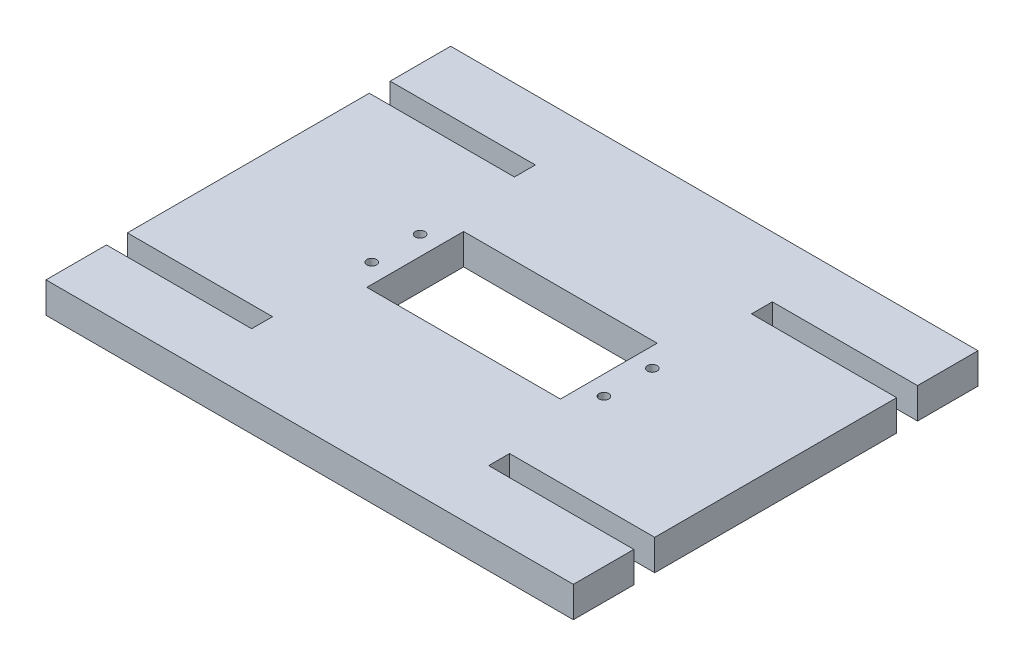
ISO-10303-21;
HEADER;
FILE_DESCRIPTION(('STEP AP214'),'2;1');
FILE_NAME('part.step','',(''),(''),'','','');
FILE_SCHEMA(('AUTOMOTIVE_DESIGN { 1 0 10303 214 1 1 1 1 }'));
ENDSEC;
DATA;
#1=APPLICATION_CONTEXT('core data for automotive mechanical design processes');
#2=APPLICATION_PROTOCOL_DEFINITION('international standard','automotive_design',2000,#1);
#3=PRODUCT_CONTEXT('',#1,'mechanical');
#4=PRODUCT('Part','Part','',(#3));
#5=PRODUCT_RELATED_PRODUCT_CATEGORY('part','',(#4));
#6=PRODUCT_DEFINITION_FORMATION('','',#4);
#7=PRODUCT_DEFINITION_CONTEXT('part definition',#1,'design');
#8=PRODUCT_DEFINITION('design','',#6,#7);
#9=PRODUCT_DEFINITION_SHAPE('','',#8);
#10=(LENGTH_UNIT() NAMED_UNIT(*) SI_UNIT(.MILLI.,.METRE.));
#11=(NAMED_UNIT(*) PLANE_ANGLE_UNIT() SI_UNIT($,.RADIAN.));
#12=(NAMED_UNIT(*) SI_UNIT($,.STERADIAN.) SOLID_ANGLE_UNIT());
#13=UNCERTAINTY_MEASURE_WITH_UNIT(LENGTH_MEASURE(1.E-05),#10,'distance_accuracy_value','');
#14=(GEOMETRIC_REPRESENTATION_CONTEXT(3) GLOBAL_UNCERTAINTY_ASSIGNED_CONTEXT((#13)) GLOBAL_UNIT_ASSIGNED_CONTEXT((#10,
#11,#12)) REPRESENTATION_CONTEXT('',''));
#15=CARTESIAN_POINT('',(0.,0.,0.));
#16=DIRECTION('',(0.,0.,1.));
#17=DIRECTION('',(1.,0.,0.));
#18=AXIS2_PLACEMENT_3D('',#15,#16,#17);
#19=CARTESIAN_POINT('',(0.,6.35,-83.636));
#20=DIRECTION('',(1.,0.,0.));
#21=DIRECTION('',(0.,0.,-1.));
#22=AXIS2_PLACEMENT_3D('',#19,#20,#21);
#23=PLANE('',#22);
#24=DIRECTION('',(0.,0.,1.));
#25=VECTOR('',#24,1.);
#26=CARTESIAN_POINT('',(0.,0.,-83.636));
#27=LINE('',#26,#25);
#28=CARTESIAN_POINT('',(0.,0.,-83.636));
#29=VERTEX_POINT('',#28);
#30=CARTESIAN_POINT('',(0.,0.,-71.136));
#31=VERTEX_POINT('',#30);
#32=EDGE_CURVE('E235',#29,#31,#27,.T.);
#33=ORIENTED_EDGE('',*,*,#32,.T.);
#34=DIRECTION('',(0.,-1.,0.));
#35=VECTOR('',#34,1.);
#36=CARTESIAN_POINT('',(0.,6.35,-71.136));
#37=LINE('',#36,#35);
#38=CARTESIAN_POINT('',(0.,6.35,-71.136));
#39=VERTEX_POINT('',#38);
#40=EDGE_CURVE('E11',#39,#31,#37,.T.);
#41=ORIENTED_EDGE('',*,*,#40,.F.);
#42=DIRECTION('',(0.,0.,1.));
#43=VECTOR('',#42,1.);
#44=CARTESIAN_POINT('',(0.,6.35,-83.636));
#45=LINE('',#44,#43);
#46=CARTESIAN_POINT('',(0.,6.35,-83.636));
#47=VERTEX_POINT('',#46);
#48=EDGE_CURVE('E239',#47,#39,#45,.T.);
#49=ORIENTED_EDGE('',*,*,#48,.F.);
#50=DIRECTION('',(0.,-1.,0.));
#51=VECTOR('',#50,1.);
#52=CARTESIAN_POINT('',(0.,6.35,-83.636));
#53=LINE('',#52,#51);
#54=EDGE_CURVE('E281',#47,#29,#53,.T.);
#55=ORIENTED_EDGE('',*,*,#54,.T.);
#56=EDGE_LOOP('',(#33,#41,#49,#55));
#57=FACE_BOUND('',#56,.T.);
#58=ADVANCED_FACE('F37',(#57),#23,.F.);
#59=CARTESIAN_POINT('',(0.,6.35,-71.136));
#60=DIRECTION('',(0.,0.,-1.));
#61=DIRECTION('',(-1.,0.,0.));
#62=AXIS2_PLACEMENT_3D('',#59,#60,#61);
#63=PLANE('',#62);
#64=DIRECTION('',(1.,0.,0.));
#65=VECTOR('',#64,1.);
#66=CARTESIAN_POINT('',(0.,0.,-71.136));
#67=LINE('',#66,#65);
#68=CARTESIAN_POINT('',(30.,0.,-71.136));
#69=VERTEX_POINT('',#68);
#70=EDGE_CURVE('E284',#31,#69,#67,.T.);
#71=ORIENTED_EDGE('',*,*,#70,.T.);
#72=DIRECTION('',(0.,-1.,0.));
#73=VECTOR('',#72,1.);
#74=CARTESIAN_POINT('',(30.,6.35,-71.136));
#75=LINE('',#74,#73);
#76=CARTESIAN_POINT('',(30.,6.35,-71.136));
#77=VERTEX_POINT('',#76);
#78=EDGE_CURVE('E45',#77,#69,#75,.T.);
#79=ORIENTED_EDGE('',*,*,#78,.F.);
#80=DIRECTION('',(1.,0.,0.));
#81=VECTOR('',#80,1.);
#82=CARTESIAN_POINT('',(0.,6.35,-71.136));
#83=LINE('',#82,#81);
#84=EDGE_CURVE('E242',#39,#77,#83,.T.);
#85=ORIENTED_EDGE('',*,*,#84,.F.);
#86=ORIENTED_EDGE('',*,*,#40,.T.);
#87=EDGE_LOOP('',(#71,#79,#85,#86));
#88=FACE_BOUND('',#87,.T.);
#89=ADVANCED_FACE('F416',(#88),#63,.F.);
#90=CARTESIAN_POINT('',(30.,6.35,-71.136));
#91=DIRECTION('',(1.,0.,0.));
#92=DIRECTION('',(0.,0.,-1.));
#93=AXIS2_PLACEMENT_3D('',#90,#91,#92);
#94=PLANE('',#93);
#95=DIRECTION('',(0.,0.,1.));
#96=VECTOR('',#95,1.);
#97=CARTESIAN_POINT('',(30.,0.,-71.136));
#98=LINE('',#97,#96);
#99=CARTESIAN_POINT('',(30.,0.,-66.818));
#100=VERTEX_POINT('',#99);
#101=EDGE_CURVE('E286',#69,#100,#98,.T.);
#102=ORIENTED_EDGE('',*,*,#101,.T.);
#103=DIRECTION('',(0.,-1.,0.));
#104=VECTOR('',#103,1.);
#105=CARTESIAN_POINT('',(30.,6.35,-66.818));
#106=LINE('',#105,#104);
#107=CARTESIAN_POINT('',(30.,6.35,-66.818));
#108=VERTEX_POINT('',#107);
#109=EDGE_CURVE('E371',#108,#100,#106,.T.);
#110=ORIENTED_EDGE('',*,*,#109,.F.);
#111=DIRECTION('',(0.,0.,1.));
#112=VECTOR('',#111,1.);
#113=CARTESIAN_POINT('',(30.,6.35,-71.136));
#114=LINE('',#113,#112);
#115=EDGE_CURVE('E245',#77,#108,#114,.T.);
#116=ORIENTED_EDGE('',*,*,#115,.F.);
#117=ORIENTED_EDGE('',*,*,#78,.T.);
#118=EDGE_LOOP('',(#102,#110,#116,#117));
#119=FACE_BOUND('',#118,.T.);
#120=ADVANCED_FACE('F421',(#119),#94,.F.);
#121=CARTESIAN_POINT('',(0.,6.35,-66.818));
#122=DIRECTION('',(0.,0.,1.));
#123=DIRECTION('',(1.,0.,0.));
#124=AXIS2_PLACEMENT_3D('',#121,#122,#123);
#125=PLANE('',#124);
#126=DIRECTION('',(-1.,0.,0.));
#127=VECTOR('',#126,1.);
#128=CARTESIAN_POINT('',(0.,0.,-66.818));
#129=LINE('',#128,#127);
#130=CARTESIAN_POINT('',(0.,0.,-66.818));
#131=VERTEX_POINT('',#130);
#132=EDGE_CURVE('E288',#100,#131,#129,.T.);
#133=ORIENTED_EDGE('',*,*,#132,.T.);
#134=DIRECTION('',(0.,-1.,0.));
#135=VECTOR('',#134,1.);
#136=CARTESIAN_POINT('',(0.,6.35,-66.818));
#137=LINE('',#136,#135);
#138=CARTESIAN_POINT('',(0.,6.35,-66.818));
#139=VERTEX_POINT('',#138);
#140=EDGE_CURVE('E368',#139,#131,#137,.T.);
#141=ORIENTED_EDGE('',*,*,#140,.F.);
#142=DIRECTION('',(-1.,0.,0.));
#143=VECTOR('',#142,1.);
#144=CARTESIAN_POINT('',(0.,6.35,-66.818));
#145=LINE('',#144,#143);
#146=EDGE_CURVE('E247',#108,#139,#145,.T.);
#147=ORIENTED_EDGE('',*,*,#146,.F.);
#148=ORIENTED_EDGE('',*,*,#109,.T.);
#149=EDGE_LOOP('',(#133,#141,#147,#148));
#150=FACE_BOUND('',#149,.T.);
#151=ADVANCED_FACE('F515',(#150),#125,.F.);
#152=CARTESIAN_POINT('',(0.,6.35,-66.818));
#153=DIRECTION('',(1.,0.,0.));
#154=DIRECTION('',(0.,0.,-1.));
#155=AXIS2_PLACEMENT_3D('',#152,#153,#154);
#156=PLANE('',#155);
#157=DIRECTION('',(0.,0.,1.));
#158=VECTOR('',#157,1.);
#159=CARTESIAN_POINT('',(0.,0.,-66.818));
#160=LINE('',#159,#158);
#161=CARTESIAN_POINT('',(0.,0.,-16.818));
#162=VERTEX_POINT('',#161);
#163=EDGE_CURVE('E290',#131,#162,#160,.T.);
#164=ORIENTED_EDGE('',*,*,#163,.T.);
#165=DIRECTION('',(0.,-1.,0.));
#166=VECTOR('',#165,1.);
#167=CARTESIAN_POINT('',(0.,6.35,-16.818));
#168=LINE('',#167,#166);
#169=CARTESIAN_POINT('',(0.,6.35,-16.818));
#170=VERTEX_POINT('',#169);
#171=EDGE_CURVE('E365',#170,#162,#168,.T.);
#172=ORIENTED_EDGE('',*,*,#171,.F.);
#173=DIRECTION('',(0.,0.,1.));
#174=VECTOR('',#173,1.);
#175=CARTESIAN_POINT('',(0.,6.35,-66.818));
#176=LINE('',#175,#174);
#177=EDGE_CURVE('E249',#139,#170,#176,.T.);
#178=ORIENTED_EDGE('',*,*,#177,.F.);
#179=ORIENTED_EDGE('',*,*,#140,.T.);
#180=EDGE_LOOP('',(#164,#172,#178,#179));
#181=FACE_BOUND('',#180,.T.);
#182=ADVANCED_FACE('F511',(#181),#156,.F.);
#183=CARTESIAN_POINT('',(0.,6.35,-16.818));
#184=DIRECTION('',(0.,0.,-1.));
#185=DIRECTION('',(-1.,0.,0.));
#186=AXIS2_PLACEMENT_3D('',#183,#184,#185);
#187=PLANE('',#186);
#188=DIRECTION('',(1.,0.,0.));
#189=VECTOR('',#188,1.);
#190=CARTESIAN_POINT('',(0.,0.,-16.818));
#191=LINE('',#190,#189);
#192=CARTESIAN_POINT('',(30.,0.,-16.818));
#193=VERTEX_POINT('',#192);
#194=EDGE_CURVE('E292',#162,#193,#191,.T.);
#195=ORIENTED_EDGE('',*,*,#194,.T.);
#196=DIRECTION('',(0.,-1.,0.));
#197=VECTOR('',#196,1.);
#198=CARTESIAN_POINT('',(30.,6.35,-16.818));
#199=LINE('',#198,#197);
#200=CARTESIAN_POINT('',(30.,6.35,-16.818));
#201=VERTEX_POINT('',#200);
#202=EDGE_CURVE('E362',#201,#193,#199,.T.);
#203=ORIENTED_EDGE('',*,*,#202,.F.);
#204=DIRECTION('',(1.,0.,0.));
#205=VECTOR('',#204,1.);
#206=CARTESIAN_POINT('',(0.,6.35,-16.818));
#207=LINE('',#206,#205);
#208=EDGE_CURVE('E251',#170,#201,#207,.T.);
#209=ORIENTED_EDGE('',*,*,#208,.F.);
#210=ORIENTED_EDGE('',*,*,#171,.T.);
#211=EDGE_LOOP('',(#195,#203,#209,#210));
#212=FACE_BOUND('',#211,.T.);
#213=ADVANCED_FACE('F506',(#212),#187,.F.);
#214=CARTESIAN_POINT('',(30.,6.35,-16.818));
#215=DIRECTION('',(1.,0.,0.));
#216=DIRECTION('',(0.,0.,-1.));
#217=AXIS2_PLACEMENT_3D('',#214,#215,#216);
#218=PLANE('',#217);
#219=DIRECTION('',(0.,0.,1.));
#220=VECTOR('',#219,1.);
#221=CARTESIAN_POINT('',(30.,0.,-16.818));
#222=LINE('',#221,#220);
#223=CARTESIAN_POINT('',(30.,0.,-12.5));
#224=VERTEX_POINT('',#223);
#225=EDGE_CURVE('E294',#193,#224,#222,.T.);
#226=ORIENTED_EDGE('',*,*,#225,.T.);
#227=DIRECTION('',(0.,-1.,0.));
#228=VECTOR('',#227,1.);
#229=CARTESIAN_POINT('',(30.,6.35,-12.5));
#230=LINE('',#229,#228);
#231=CARTESIAN_POINT('',(30.,6.35,-12.5));
#232=VERTEX_POINT('',#231);
#233=EDGE_CURVE('E359',#232,#224,#230,.T.);
#234=ORIENTED_EDGE('',*,*,#233,.F.);
#235=DIRECTION('',(0.,0.,1.));
#236=VECTOR('',#235,1.);
#237=CARTESIAN_POINT('',(30.,6.35,-16.818));
#238=LINE('',#237,#236);
#239=EDGE_CURVE('E253',#201,#232,#238,.T.);
#240=ORIENTED_EDGE('',*,*,#239,.F.);
#241=ORIENTED_EDGE('',*,*,#202,.T.);
#242=EDGE_LOOP('',(#226,#234,#240,#241));
#243=FACE_BOUND('',#242,.T.);
#244=ADVANCED_FACE('F501',(#243),#218,.F.);
#245=CARTESIAN_POINT('',(0.,6.35,-12.5));
#246=DIRECTION('',(0.,0.,1.));
#247=DIRECTION('',(1.,0.,0.));
#248=AXIS2_PLACEMENT_3D('',#245,#246,#247);
#249=PLANE('',#248);
#250=DIRECTION('',(-1.,0.,0.));
#251=VECTOR('',#250,1.);
#252=CARTESIAN_POINT('',(0.,0.,-12.5));
#253=LINE('',#252,#251);
#254=CARTESIAN_POINT('',(0.,0.,-12.5));
#255=VERTEX_POINT('',#254);
#256=EDGE_CURVE('E296',#224,#255,#253,.T.);
#257=ORIENTED_EDGE('',*,*,#256,.T.);
#258=DIRECTION('',(0.,-1.,0.));
#259=VECTOR('',#258,1.);
#260=CARTESIAN_POINT('',(0.,6.35,-12.5));
#261=LINE('',#260,#259);
#262=CARTESIAN_POINT('',(0.,6.35,-12.5));
#263=VERTEX_POINT('',#262);
#264=EDGE_CURVE('E356',#263,#255,#261,.T.);
#265=ORIENTED_EDGE('',*,*,#264,.F.);
#266=DIRECTION('',(-1.,0.,0.));
#267=VECTOR('',#266,1.);
#268=CARTESIAN_POINT('',(0.,6.35,-12.5));
#269=LINE('',#268,#267);
#270=EDGE_CURVE('E255',#232,#263,#269,.T.);
#271=ORIENTED_EDGE('',*,*,#270,.F.);
#272=ORIENTED_EDGE('',*,*,#233,.T.);
#273=EDGE_LOOP('',(#257,#265,#271,#272));
#274=FACE_BOUND('',#273,.T.);
#275=ADVANCED_FACE('F497',(#274),#249,.F.);
#276=CARTESIAN_POINT('',(0.,6.35,-12.5));
#277=DIRECTION('',(1.,0.,0.));
#278=DIRECTION('',(0.,0.,-1.));
#279=AXIS2_PLACEMENT_3D('',#276,#277,#278);
#280=PLANE('',#279);
#281=DIRECTION('',(0.,0.,1.));
#282=VECTOR('',#281,1.);
#283=CARTESIAN_POINT('',(0.,0.,-12.5));
#284=LINE('',#283,#282);
#285=CARTESIAN_POINT('',(0.,0.,0.));
#286=VERTEX_POINT('',#285);
#287=EDGE_CURVE('E298',#255,#286,#284,.T.);
#288=ORIENTED_EDGE('',*,*,#287,.T.);
#289=DIRECTION('',(0.,-1.,0.));
#290=VECTOR('',#289,1.);
#291=CARTESIAN_POINT('',(0.,6.35,0.));
#292=LINE('',#291,#290);
#293=CARTESIAN_POINT('',(0.,6.35,0.));
#294=VERTEX_POINT('',#293);
#295=EDGE_CURVE('E353',#294,#286,#292,.T.);
#296=ORIENTED_EDGE('',*,*,#295,.F.);
#297=DIRECTION('',(0.,0.,1.));
#298=VECTOR('',#297,1.);
#299=CARTESIAN_POINT('',(0.,6.35,-12.5));
#300=LINE('',#299,#298);
#301=EDGE_CURVE('E257',#263,#294,#300,.T.);
#302=ORIENTED_EDGE('',*,*,#301,.F.);
#303=ORIENTED_EDGE('',*,*,#264,.T.);
#304=EDGE_LOOP('',(#288,#296,#302,#303));
#305=FACE_BOUND('',#304,.T.);
#306=ADVANCED_FACE('F492',(#305),#280,.F.);
#307=CARTESIAN_POINT('',(0.,6.35,0.));
#308=DIRECTION('',(0.,0.,-1.));
#309=DIRECTION('',(-1.,0.,0.));
#310=AXIS2_PLACEMENT_3D('',#307,#308,#309);
#311=PLANE('',#310);
#312=DIRECTION('',(1.,0.,0.));
#313=VECTOR('',#312,1.);
#314=CARTESIAN_POINT('',(0.,0.,0.));
#315=LINE('',#314,#313);
#316=CARTESIAN_POINT('',(109.,0.,0.));
#317=VERTEX_POINT('',#316);
#318=EDGE_CURVE('E300',#286,#317,#315,.T.);
#319=ORIENTED_EDGE('',*,*,#318,.T.);
#320=DIRECTION('',(0.,-1.,0.));
#321=VECTOR('',#320,1.);
#322=CARTESIAN_POINT('',(109.,6.35,0.));
#323=LINE('',#322,#321);
#324=CARTESIAN_POINT('',(109.,6.35,0.));
#325=VERTEX_POINT('',#324);
#326=EDGE_CURVE('E350',#325,#317,#323,.T.);
#327=ORIENTED_EDGE('',*,*,#326,.F.);
#328=DIRECTION('',(1.,0.,0.));
#329=VECTOR('',#328,1.);
#330=CARTESIAN_POINT('',(0.,6.35,0.));
#331=LINE('',#330,#329);
#332=EDGE_CURVE('E259',#294,#325,#331,.T.);
#333=ORIENTED_EDGE('',*,*,#332,.F.);
#334=ORIENTED_EDGE('',*,*,#295,.T.);
#335=EDGE_LOOP('',(#319,#327,#333,#334));
#336=FACE_BOUND('',#335,.T.);
#337=ADVANCED_FACE('F486',(#336),#311,.F.);
#338=CARTESIAN_POINT('',(109.,6.35,-12.5));
#339=DIRECTION('',(-1.,0.,0.));
#340=DIRECTION('',(0.,0.,1.));
#341=AXIS2_PLACEMENT_3D('',#338,#339,#340);
#342=PLANE('',#341);
#343=DIRECTION('',(0.,0.,-1.));
#344=VECTOR('',#343,1.);
#345=CARTESIAN_POINT('',(109.,0.,-12.5));
#346=LINE('',#345,#344);
#347=CARTESIAN_POINT('',(109.,0.,-12.5));
#348=VERTEX_POINT('',#347);
#349=EDGE_CURVE('E302',#317,#348,#346,.T.);
#350=ORIENTED_EDGE('',*,*,#349,.T.);
#351=DIRECTION('',(0.,-1.,0.));
#352=VECTOR('',#351,1.);
#353=CARTESIAN_POINT('',(109.,6.35,-12.5));
#354=LINE('',#353,#352);
#355=CARTESIAN_POINT('',(109.,6.35,-12.5));
#356=VERTEX_POINT('',#355);
#357=EDGE_CURVE('E347',#356,#348,#354,.T.);
#358=ORIENTED_EDGE('',*,*,#357,.F.);
#359=DIRECTION('',(0.,0.,-1.));
#360=VECTOR('',#359,1.);
#361=CARTESIAN_POINT('',(109.,6.35,-12.5));
#362=LINE('',#361,#360);
#363=EDGE_CURVE('E261',#325,#356,#362,.T.);
#364=ORIENTED_EDGE('',*,*,#363,.F.);
#365=ORIENTED_EDGE('',*,*,#326,.T.);
#366=EDGE_LOOP('',(#350,#358,#364,#365));
#367=FACE_BOUND('',#366,.T.);
#368=ADVANCED_FACE('F482',(#367),#342,.F.);
#369=CARTESIAN_POINT('',(109.,6.35,-12.5));
#370=DIRECTION('',(0.,0.,1.));
#371=DIRECTION('',(1.,0.,0.));
#372=AXIS2_PLACEMENT_3D('',#369,#370,#371);
#373=PLANE('',#372);
#374=DIRECTION('',(-1.,0.,0.));
#375=VECTOR('',#374,1.);
#376=CARTESIAN_POINT('',(109.,0.,-12.5));
#377=LINE('',#376,#375);
#378=CARTESIAN_POINT('',(79.,0.,-12.5));
#379=VERTEX_POINT('',#378);
#380=EDGE_CURVE('E304',#348,#379,#377,.T.);
#381=ORIENTED_EDGE('',*,*,#380,.T.);
#382=DIRECTION('',(0.,-1.,0.));
#383=VECTOR('',#382,1.);
#384=CARTESIAN_POINT('',(79.,6.35,-12.5));
#385=LINE('',#384,#383);
#386=CARTESIAN_POINT('',(79.,6.35,-12.5));
#387=VERTEX_POINT('',#386);
#388=EDGE_CURVE('E344',#387,#379,#385,.T.);
#389=ORIENTED_EDGE('',*,*,#388,.F.);
#390=DIRECTION('',(-1.,0.,0.));
#391=VECTOR('',#390,1.);
#392=CARTESIAN_POINT('',(109.,6.35,-12.5));
#393=LINE('',#392,#391);
#394=EDGE_CURVE('E263',#356,#387,#393,.T.);
#395=ORIENTED_EDGE('',*,*,#394,.F.);
#396=ORIENTED_EDGE('',*,*,#357,.T.);
#397=EDGE_LOOP('',(#381,#389,#395,#396));
#398=FACE_BOUND('',#397,.T.);
#399=ADVANCED_FACE('F477',(#398),#373,.F.);
#400=CARTESIAN_POINT('',(79.,6.35,-12.5));
#401=DIRECTION('',(-1.,0.,0.));
#402=DIRECTION('',(0.,0.,1.));
#403=AXIS2_PLACEMENT_3D('',#400,#401,#402);
#404=PLANE('',#403);
#405=DIRECTION('',(0.,0.,-1.));
#406=VECTOR('',#405,1.);
#407=CARTESIAN_POINT('',(79.,0.,-12.5));
#408=LINE('',#407,#406);
#409=CARTESIAN_POINT('',(79.,0.,-16.818));
#410=VERTEX_POINT('',#409);
#411=EDGE_CURVE('E306',#379,#410,#408,.T.);
#412=ORIENTED_EDGE('',*,*,#411,.T.);
#413=DIRECTION('',(0.,-1.,0.));
#414=VECTOR('',#413,1.);
#415=CARTESIAN_POINT('',(79.,6.35,-16.818));
#416=LINE('',#415,#414);
#417=CARTESIAN_POINT('',(79.,6.35,-16.818));
#418=VERTEX_POINT('',#417);
#419=EDGE_CURVE('E341',#418,#410,#416,.T.);
#420=ORIENTED_EDGE('',*,*,#419,.F.);
#421=DIRECTION('',(0.,0.,-1.));
#422=VECTOR('',#421,1.);
#423=CARTESIAN_POINT('',(79.,6.35,-12.5));
#424=LINE('',#423,#422);
#425=EDGE_CURVE('E265',#387,#418,#424,.T.);
#426=ORIENTED_EDGE('',*,*,#425,.F.);
#427=ORIENTED_EDGE('',*,*,#388,.T.);
#428=EDGE_LOOP('',(#412,#420,#426,#427));
#429=FACE_BOUND('',#428,.T.);
#430=ADVANCED_FACE('F471',(#429),#404,.F.);
#431=CARTESIAN_POINT('',(109.,6.35,-16.818));
#432=DIRECTION('',(0.,0.,-1.));
#433=DIRECTION('',(-1.,0.,0.));
#434=AXIS2_PLACEMENT_3D('',#431,#432,#433);
#435=PLANE('',#434);
#436=DIRECTION('',(1.,0.,0.));
#437=VECTOR('',#436,1.);
#438=CARTESIAN_POINT('',(109.,0.,-16.818));
#439=LINE('',#438,#437);
#440=CARTESIAN_POINT('',(109.,0.,-16.818));
#441=VERTEX_POINT('',#440);
#442=EDGE_CURVE('E308',#410,#441,#439,.T.);
#443=ORIENTED_EDGE('',*,*,#442,.T.);
#444=DIRECTION('',(0.,-1.,0.));
#445=VECTOR('',#444,1.);
#446=CARTESIAN_POINT('',(109.,6.35,-16.818));
#447=LINE('',#446,#445);
#448=CARTESIAN_POINT('',(109.,6.35,-16.818));
#449=VERTEX_POINT('',#448);
#450=EDGE_CURVE('E338',#449,#441,#447,.T.);
#451=ORIENTED_EDGE('',*,*,#450,.F.);
#452=DIRECTION('',(1.,0.,0.));
#453=VECTOR('',#452,1.);
#454=CARTESIAN_POINT('',(109.,6.35,-16.818));
#455=LINE('',#454,#453);
#456=EDGE_CURVE('E267',#418,#449,#455,.T.);
#457=ORIENTED_EDGE('',*,*,#456,.F.);
#458=ORIENTED_EDGE('',*,*,#419,.T.);
#459=EDGE_LOOP('',(#443,#451,#457,#458));
#460=FACE_BOUND('',#459,.T.);
#461=ADVANCED_FACE('F467',(#460),#435,.F.);
#462=CARTESIAN_POINT('',(109.,6.35,-66.818));
#463=DIRECTION('',(-1.,0.,0.));
#464=DIRECTION('',(0.,0.,1.));
#465=AXIS2_PLACEMENT_3D('',#462,#463,#464);
#466=PLANE('',#465);
#467=DIRECTION('',(0.,0.,-1.));
#468=VECTOR('',#467,1.);
#469=CARTESIAN_POINT('',(109.,0.,-66.818));
#470=LINE('',#469,#468);
#471=CARTESIAN_POINT('',(109.,0.,-66.818));
#472=VERTEX_POINT('',#471);
#473=EDGE_CURVE('E310',#441,#472,#470,.T.);
#474=ORIENTED_EDGE('',*,*,#473,.T.);
#475=DIRECTION('',(0.,-1.,0.));
#476=VECTOR('',#475,1.);
#477=CARTESIAN_POINT('',(109.,6.35,-66.818));
#478=LINE('',#477,#476);
#479=CARTESIAN_POINT('',(109.,6.35,-66.818));
#480=VERTEX_POINT('',#479);
#481=EDGE_CURVE('E335',#480,#472,#478,.T.);
#482=ORIENTED_EDGE('',*,*,#481,.F.);
#483=DIRECTION('',(0.,0.,-1.));
#484=VECTOR('',#483,1.);
#485=CARTESIAN_POINT('',(109.,6.35,-66.818));
#486=LINE('',#485,#484);
#487=EDGE_CURVE('E269',#449,#480,#486,.T.);
#488=ORIENTED_EDGE('',*,*,#487,.F.);
#489=ORIENTED_EDGE('',*,*,#450,.T.);
#490=EDGE_LOOP('',(#474,#482,#488,#489));
#491=FACE_BOUND('',#490,.T.);
#492=ADVANCED_FACE('F462',(#491),#466,.F.);
#493=CARTESIAN_POINT('',(109.,6.35,-66.818));
#494=DIRECTION('',(0.,0.,1.));
#495=DIRECTION('',(1.,0.,0.));
#496=AXIS2_PLACEMENT_3D('',#493,#494,#495);
#497=PLANE('',#496);
#498=DIRECTION('',(-1.,0.,0.));
#499=VECTOR('',#498,1.);
#500=CARTESIAN_POINT('',(109.,0.,-66.818));
#501=LINE('',#500,#499);
#502=CARTESIAN_POINT('',(79.,0.,-66.818));
#503=VERTEX_POINT('',#502);
#504=EDGE_CURVE('E312',#472,#503,#501,.T.);
#505=ORIENTED_EDGE('',*,*,#504,.T.);
#506=DIRECTION('',(0.,-1.,0.));
#507=VECTOR('',#506,1.);
#508=CARTESIAN_POINT('',(79.,6.35,-66.818));
#509=LINE('',#508,#507);
#510=CARTESIAN_POINT('',(79.,6.35,-66.818));
#511=VERTEX_POINT('',#510);
#512=EDGE_CURVE('E332',#511,#503,#509,.T.);
#513=ORIENTED_EDGE('',*,*,#512,.F.);
#514=DIRECTION('',(-1.,0.,0.));
#515=VECTOR('',#514,1.);
#516=CARTESIAN_POINT('',(109.,6.35,-66.818));
#517=LINE('',#516,#515);
#518=EDGE_CURVE('E271',#480,#511,#517,.T.);
#519=ORIENTED_EDGE('',*,*,#518,.F.);
#520=ORIENTED_EDGE('',*,*,#481,.T.);
#521=EDGE_LOOP('',(#505,#513,#519,#520));
#522=FACE_BOUND('',#521,.T.);
#523=ADVANCED_FACE('F456',(#522),#497,.F.);
#524=CARTESIAN_POINT('',(79.,6.35,-66.818));
#525=DIRECTION('',(-1.,0.,0.));
#526=DIRECTION('',(0.,0.,1.));
#527=AXIS2_PLACEMENT_3D('',#524,#525,#526);
#528=PLANE('',#527);
#529=DIRECTION('',(0.,0.,-1.));
#530=VECTOR('',#529,1.);
#531=CARTESIAN_POINT('',(79.,0.,-66.818));
#532=LINE('',#531,#530);
#533=CARTESIAN_POINT('',(79.,0.,-71.136));
#534=VERTEX_POINT('',#533);
#535=EDGE_CURVE('E314',#503,#534,#532,.T.);
#536=ORIENTED_EDGE('',*,*,#535,.T.);
#537=DIRECTION('',(0.,-1.,0.));
#538=VECTOR('',#537,1.);
#539=CARTESIAN_POINT('',(79.,6.35,-71.136));
#540=LINE('',#539,#538);
#541=CARTESIAN_POINT('',(79.,6.35,-71.136));
#542=VERTEX_POINT('',#541);
#543=EDGE_CURVE('E329',#542,#534,#540,.T.);
#544=ORIENTED_EDGE('',*,*,#543,.F.);
#545=DIRECTION('',(0.,0.,-1.));
#546=VECTOR('',#545,1.);
#547=CARTESIAN_POINT('',(79.,6.35,-66.818));
#548=LINE('',#547,#546);
#549=EDGE_CURVE('E273',#511,#542,#548,.T.);
#550=ORIENTED_EDGE('',*,*,#549,.F.);
#551=ORIENTED_EDGE('',*,*,#512,.T.);
#552=EDGE_LOOP('',(#536,#544,#550,#551));
#553=FACE_BOUND('',#552,.T.);
#554=ADVANCED_FACE('F452',(#553),#528,.F.);
#555=CARTESIAN_POINT('',(109.,6.35,-71.136));
#556=DIRECTION('',(0.,0.,-1.));
#557=DIRECTION('',(-1.,0.,0.));
#558=AXIS2_PLACEMENT_3D('',#555,#556,#557);
#559=PLANE('',#558);
#560=DIRECTION('',(1.,0.,0.));
#561=VECTOR('',#560,1.);
#562=CARTESIAN_POINT('',(109.,0.,-71.136));
#563=LINE('',#562,#561);
#564=CARTESIAN_POINT('',(109.,0.,-71.136));
#565=VERTEX_POINT('',#564);
#566=EDGE_CURVE('E316',#534,#565,#563,.T.);
#567=ORIENTED_EDGE('',*,*,#566,.T.);
#568=DIRECTION('',(0.,-1.,0.));
#569=VECTOR('',#568,1.);
#570=CARTESIAN_POINT('',(109.,6.35,-71.136));
#571=LINE('',#570,#569);
#572=CARTESIAN_POINT('',(109.,6.35,-71.136));
#573=VERTEX_POINT('',#572);
#574=EDGE_CURVE('E326',#573,#565,#571,.T.);
#575=ORIENTED_EDGE('',*,*,#574,.F.);
#576=DIRECTION('',(1.,0.,0.));
#577=VECTOR('',#576,1.);
#578=CARTESIAN_POINT('',(109.,6.35,-71.136));
#579=LINE('',#578,#577);
#580=EDGE_CURVE('E275',#542,#573,#579,.T.);
#581=ORIENTED_EDGE('',*,*,#580,.F.);
#582=ORIENTED_EDGE('',*,*,#543,.T.);
#583=EDGE_LOOP('',(#567,#575,#581,#582));
#584=FACE_BOUND('',#583,.T.);
#585=ADVANCED_FACE('F447',(#584),#559,.F.);
#586=CARTESIAN_POINT('',(109.,6.35,-83.636));
#587=DIRECTION('',(-1.,0.,0.));
#588=DIRECTION('',(0.,0.,1.));
#589=AXIS2_PLACEMENT_3D('',#586,#587,#588);
#590=PLANE('',#589);
#591=DIRECTION('',(0.,0.,-1.));
#592=VECTOR('',#591,1.);
#593=CARTESIAN_POINT('',(109.,0.,-83.636));
#594=LINE('',#593,#592);
#595=CARTESIAN_POINT('',(109.,0.,-83.636));
#596=VERTEX_POINT('',#595);
#597=EDGE_CURVE('E318',#565,#596,#594,.T.);
#598=ORIENTED_EDGE('',*,*,#597,.T.);
#599=DIRECTION('',(0.,-1.,0.));
#600=VECTOR('',#599,1.);
#601=CARTESIAN_POINT('',(109.,6.35,-83.636));
#602=LINE('',#601,#600);
#603=CARTESIAN_POINT('',(109.,6.35,-83.636));
#604=VERTEX_POINT('',#603);
#605=EDGE_CURVE('E323',#604,#596,#602,.T.);
#606=ORIENTED_EDGE('',*,*,#605,.F.);
#607=DIRECTION('',(0.,0.,-1.));
#608=VECTOR('',#607,1.);
#609=CARTESIAN_POINT('',(109.,6.35,-83.636));
#610=LINE('',#609,#608);
#611=EDGE_CURVE('E277',#573,#604,#610,.T.);
#612=ORIENTED_EDGE('',*,*,#611,.F.);
#613=ORIENTED_EDGE('',*,*,#574,.T.);
#614=EDGE_LOOP('',(#598,#606,#612,#613));
#615=FACE_BOUND('',#614,.T.);
#616=ADVANCED_FACE('F441',(#615),#590,.F.);
#617=CARTESIAN_POINT('',(0.,6.35,-83.636));
#618=DIRECTION('',(0.,0.,1.));
#619=DIRECTION('',(1.,0.,0.));
#620=AXIS2_PLACEMENT_3D('',#617,#618,#619);
#621=PLANE('',#620);
#622=DIRECTION('',(-1.,0.,0.));
#623=VECTOR('',#622,1.);
#624=CARTESIAN_POINT('',(0.,0.,-83.636));
#625=LINE('',#624,#623);
#626=EDGE_CURVE('E243',#596,#29,#625,.T.);
#627=ORIENTED_EDGE('',*,*,#626,.T.);
#628=ORIENTED_EDGE('',*,*,#54,.F.);
#629=DIRECTION('',(-1.,0.,0.));
#630=VECTOR('',#629,1.);
#631=CARTESIAN_POINT('',(0.,6.35,-83.636));
#632=LINE('',#631,#630);
#633=EDGE_CURVE('E279',#604,#47,#632,.T.);
#634=ORIENTED_EDGE('',*,*,#633,.F.);
#635=ORIENTED_EDGE('',*,*,#605,.T.);
#636=EDGE_LOOP('',(#627,#628,#634,#635));
#637=FACE_BOUND('',#636,.T.);
#638=ADVANCED_FACE('F439',(#637),#621,.F.);
#639=CARTESIAN_POINT('',(0.,6.35,-71.136));
#640=DIRECTION('',(0.,1.,0.));
#641=DIRECTION('',(0.,0.,1.));
#642=AXIS2_PLACEMENT_3D('',#639,#640,#641);
#643=PLANE('',#642);
#644=CARTESIAN_POINT('',(30.5,6.35,-36.818));
#645=DIRECTION('',(0.,1.,0.));
#646=DIRECTION('',(0.,0.,1.));
#647=AXIS2_PLACEMENT_3D('',#644,#645,#646);
#648=CIRCLE('',#647,0.99695);
#649=CARTESIAN_POINT('',(30.5,6.35,-35.82105));
#650=VERTEX_POINT('',#649);
#651=EDGE_CURVE('E392',#650,#650,#648,.T.);
#652=ORIENTED_EDGE('',*,*,#651,.F.);
#653=EDGE_LOOP('',(#652));
#654=FACE_BOUND('',#653,.T.);
#655=CARTESIAN_POINT('',(30.5,6.35,-46.818));
#656=DIRECTION('',(0.,1.,0.));
#657=DIRECTION('',(0.,0.,1.));
#658=AXIS2_PLACEMENT_3D('',#655,#656,#657);
#659=CIRCLE('',#658,0.99695);
#660=CARTESIAN_POINT('',(30.5,6.35,-45.82105));
#661=VERTEX_POINT('',#660);
#662=EDGE_CURVE('E382',#661,#661,#659,.T.);
#663=ORIENTED_EDGE('',*,*,#662,.F.);
#664=EDGE_LOOP('',(#663));
#665=FACE_BOUND('',#664,.T.);
#666=CARTESIAN_POINT('',(78.5,6.35,-36.818));
#667=DIRECTION('',(0.,1.,0.));
#668=DIRECTION('',(0.,0.,1.));
#669=AXIS2_PLACEMENT_3D('',#666,#667,#668);
#670=CIRCLE('',#669,0.996949999999996);
#671=CARTESIAN_POINT('',(78.5,6.35,-35.82105));
#672=VERTEX_POINT('',#671);
#673=EDGE_CURVE('E379',#672,#672,#670,.T.);
#674=ORIENTED_EDGE('',*,*,#673,.F.);
#675=EDGE_LOOP('',(#674));
#676=FACE_BOUND('',#675,.T.);
#677=CARTESIAN_POINT('',(78.5,6.35,-46.818));
#678=DIRECTION('',(0.,1.,0.));
#679=DIRECTION('',(0.,0.,1.));
#680=AXIS2_PLACEMENT_3D('',#677,#678,#679);
#681=CIRCLE('',#680,0.996949999999996);
#682=CARTESIAN_POINT('',(78.5,6.35,-45.82105));
#683=VERTEX_POINT('',#682);
#684=EDGE_CURVE('E378',#683,#683,#681,.T.);
#685=ORIENTED_EDGE('',*,*,#684,.F.);
#686=EDGE_LOOP('',(#685));
#687=FACE_BOUND('',#686,.T.);
#688=DIRECTION('',(0.,0.,1.));
#689=VECTOR('',#688,1.);
#690=CARTESIAN_POINT('',(34.5,6.35,-51.818));
#691=LINE('',#690,#689);
#692=CARTESIAN_POINT('',(34.5,6.35,-51.818));
#693=VERTEX_POINT('',#692);
#694=CARTESIAN_POINT('',(34.5,6.35,-31.818));
#695=VERTEX_POINT('',#694);
#696=EDGE_CURVE('E53',#693,#695,#691,.T.);
#697=ORIENTED_EDGE('',*,*,#696,.F.);
#698=DIRECTION('',(-1.,0.,0.));
#699=VECTOR('',#698,1.);
#700=CARTESIAN_POINT('',(34.5,6.35,-51.818));
#701=LINE('',#700,#699);
#702=CARTESIAN_POINT('',(74.5,6.35,-51.818));
#703=VERTEX_POINT('',#702);
#704=EDGE_CURVE('E217',#703,#693,#701,.T.);
#705=ORIENTED_EDGE('',*,*,#704,.F.);
#706=DIRECTION('',(0.,0.,-1.));
#707=VECTOR('',#706,1.);
#708=CARTESIAN_POINT('',(74.5,6.35,-51.818));
#709=LINE('',#708,#707);
#710=CARTESIAN_POINT('',(74.5,6.35,-31.818));
#711=VERTEX_POINT('',#710);
#712=EDGE_CURVE('E220',#711,#703,#709,.T.);
#713=ORIENTED_EDGE('',*,*,#712,.F.);
#714=DIRECTION('',(1.,0.,0.));
#715=VECTOR('',#714,1.);
#716=CARTESIAN_POINT('',(34.5,6.35,-31.818));
#717=LINE('',#716,#715);
#718=EDGE_CURVE('E229',#695,#711,#717,.T.);
#719=ORIENTED_EDGE('',*,*,#718,.F.);
#720=EDGE_LOOP('',(#697,#705,#713,#719));
#721=FACE_BOUND('',#720,.T.);
#722=ORIENTED_EDGE('',*,*,#48,.T.);
#723=ORIENTED_EDGE('',*,*,#84,.T.);
#724=ORIENTED_EDGE('',*,*,#115,.T.);
#725=ORIENTED_EDGE('',*,*,#146,.T.);
#726=ORIENTED_EDGE('',*,*,#177,.T.);
#727=ORIENTED_EDGE('',*,*,#208,.T.);
#728=ORIENTED_EDGE('',*,*,#239,.T.);
#729=ORIENTED_EDGE('',*,*,#270,.T.);
#730=ORIENTED_EDGE('',*,*,#301,.T.);
#731=ORIENTED_EDGE('',*,*,#332,.T.);
#732=ORIENTED_EDGE('',*,*,#363,.T.);
#733=ORIENTED_EDGE('',*,*,#394,.T.);
#734=ORIENTED_EDGE('',*,*,#425,.T.);
#735=ORIENTED_EDGE('',*,*,#456,.T.);
#736=ORIENTED_EDGE('',*,*,#487,.T.);
#737=ORIENTED_EDGE('',*,*,#518,.T.);
#738=ORIENTED_EDGE('',*,*,#549,.T.);
#739=ORIENTED_EDGE('',*,*,#580,.T.);
#740=ORIENTED_EDGE('',*,*,#611,.T.);
#741=ORIENTED_EDGE('',*,*,#633,.T.);
#742=EDGE_LOOP('',(#722,#723,#724,#725,#726,#727,#728,#729,#730,#731,#732,#733,#734,#735,#736,
#737,#738,#739,#740,#741));
#743=FACE_BOUND('',#742,.T.);
#744=ADVANCED_FACE('F434',(#654,#665,#676,#687,#721,#743),#643,.T.);
#745=CARTESIAN_POINT('',(0.,0.,-71.136));
#746=DIRECTION('',(0.,1.,0.));
#747=DIRECTION('',(0.,0.,1.));
#748=AXIS2_PLACEMENT_3D('',#745,#746,#747);
#749=PLANE('',#748);
#750=CARTESIAN_POINT('',(30.5,0.,-36.818));
#751=DIRECTION('',(0.,1.,0.));
#752=DIRECTION('',(0.,0.,1.));
#753=AXIS2_PLACEMENT_3D('',#750,#751,#752);
#754=CIRCLE('',#753,0.99695);
#755=CARTESIAN_POINT('',(30.5,0.,-35.82105));
#756=VERTEX_POINT('',#755);
#757=EDGE_CURVE('E40',#756,#756,#754,.T.);
#758=ORIENTED_EDGE('',*,*,#757,.T.);
#759=EDGE_LOOP('',(#758));
#760=FACE_BOUND('',#759,.T.);
#761=CARTESIAN_POINT('',(30.5,0.,-46.818));
#762=DIRECTION('',(0.,1.,0.));
#763=DIRECTION('',(0.,0.,1.));
#764=AXIS2_PLACEMENT_3D('',#761,#762,#763);
#765=CIRCLE('',#764,0.99695);
#766=CARTESIAN_POINT('',(30.5,0.,-45.82105));
#767=VERTEX_POINT('',#766);
#768=EDGE_CURVE('E380',#767,#767,#765,.T.);
#769=ORIENTED_EDGE('',*,*,#768,.T.);
#770=EDGE_LOOP('',(#769));
#771=FACE_BOUND('',#770,.T.);
#772=CARTESIAN_POINT('',(78.5,0.,-36.818));
#773=DIRECTION('',(0.,1.,0.));
#774=DIRECTION('',(0.,0.,1.));
#775=AXIS2_PLACEMENT_3D('',#772,#773,#774);
#776=CIRCLE('',#775,0.996949999999996);
#777=CARTESIAN_POINT('',(78.5,0.,-35.82105));
#778=VERTEX_POINT('',#777);
#779=EDGE_CURVE('E376',#778,#778,#776,.T.);
#780=ORIENTED_EDGE('',*,*,#779,.T.);
#781=EDGE_LOOP('',(#780));
#782=FACE_BOUND('',#781,.T.);
#783=CARTESIAN_POINT('',(78.5,0.,-46.818));
#784=DIRECTION('',(0.,1.,0.));
#785=DIRECTION('',(0.,0.,1.));
#786=AXIS2_PLACEMENT_3D('',#783,#784,#785);
#787=CIRCLE('',#786,0.996949999999996);
#788=CARTESIAN_POINT('',(78.5,0.,-45.82105));
#789=VERTEX_POINT('',#788);
#790=EDGE_CURVE('E223',#789,#789,#787,.T.);
#791=ORIENTED_EDGE('',*,*,#790,.T.);
#792=EDGE_LOOP('',(#791));
#793=FACE_BOUND('',#792,.T.);
#794=DIRECTION('',(-1.,0.,0.));
#795=VECTOR('',#794,1.);
#796=CARTESIAN_POINT('',(34.5,0.,-51.818));
#797=LINE('',#796,#795);
#798=CARTESIAN_POINT('',(74.5,0.,-51.818));
#799=VERTEX_POINT('',#798);
#800=CARTESIAN_POINT('',(34.5,0.,-51.818));
#801=VERTEX_POINT('',#800);
#802=EDGE_CURVE('E207',#799,#801,#797,.T.);
#803=ORIENTED_EDGE('',*,*,#802,.T.);
#804=DIRECTION('',(0.,0.,1.));
#805=VECTOR('',#804,1.);
#806=CARTESIAN_POINT('',(34.5,0.,-51.818));
#807=LINE('',#806,#805);
#808=CARTESIAN_POINT('',(34.5,0.,-31.818));
#809=VERTEX_POINT('',#808);
#810=EDGE_CURVE('E201',#801,#809,#807,.T.);
#811=ORIENTED_EDGE('',*,*,#810,.T.);
#812=DIRECTION('',(1.,0.,0.));
#813=VECTOR('',#812,1.);
#814=CARTESIAN_POINT('',(34.5,0.,-31.818));
#815=LINE('',#814,#813);
#816=CARTESIAN_POINT('',(74.5,0.,-31.818));
#817=VERTEX_POINT('',#816);
#818=EDGE_CURVE('E210',#809,#817,#815,.T.);
#819=ORIENTED_EDGE('',*,*,#818,.T.);
#820=DIRECTION('',(0.,0.,-1.));
#821=VECTOR('',#820,1.);
#822=CARTESIAN_POINT('',(74.5,0.,-51.818));
#823=LINE('',#822,#821);
#824=EDGE_CURVE('E61',#817,#799,#823,.T.);
#825=ORIENTED_EDGE('',*,*,#824,.T.);
#826=EDGE_LOOP('',(#803,#811,#819,#825));
#827=FACE_BOUND('',#826,.T.);
#828=ORIENTED_EDGE('',*,*,#32,.F.);
#829=ORIENTED_EDGE('',*,*,#626,.F.);
#830=ORIENTED_EDGE('',*,*,#597,.F.);
#831=ORIENTED_EDGE('',*,*,#566,.F.);
#832=ORIENTED_EDGE('',*,*,#535,.F.);
#833=ORIENTED_EDGE('',*,*,#504,.F.);
#834=ORIENTED_EDGE('',*,*,#473,.F.);
#835=ORIENTED_EDGE('',*,*,#442,.F.);
#836=ORIENTED_EDGE('',*,*,#411,.F.);
#837=ORIENTED_EDGE('',*,*,#380,.F.);
#838=ORIENTED_EDGE('',*,*,#349,.F.);
#839=ORIENTED_EDGE('',*,*,#318,.F.);
#840=ORIENTED_EDGE('',*,*,#287,.F.);
#841=ORIENTED_EDGE('',*,*,#256,.F.);
#842=ORIENTED_EDGE('',*,*,#225,.F.);
#843=ORIENTED_EDGE('',*,*,#194,.F.);
#844=ORIENTED_EDGE('',*,*,#163,.F.);
#845=ORIENTED_EDGE('',*,*,#132,.F.);
#846=ORIENTED_EDGE('',*,*,#101,.F.);
#847=ORIENTED_EDGE('',*,*,#70,.F.);
#848=EDGE_LOOP('',(#828,#829,#830,#831,#832,#833,#834,#835,#836,#837,#838,#839,#840,#841,#842,
#843,#844,#845,#846,#847));
#849=FACE_BOUND('',#848,.T.);
#850=ADVANCED_FACE('F214',(#760,#771,#782,#793,#827,#849),#749,.F.);
#851=CARTESIAN_POINT('',(34.5,0.,-51.818));
#852=DIRECTION('',(-1.,0.,0.));
#853=DIRECTION('',(0.,0.,1.));
#854=AXIS2_PLACEMENT_3D('',#851,#852,#853);
#855=PLANE('',#854);
#856=ORIENTED_EDGE('',*,*,#696,.T.);
#857=DIRECTION('',(0.,1.,0.));
#858=VECTOR('',#857,1.);
#859=CARTESIAN_POINT('',(34.5,0.,-31.818));
#860=LINE('',#859,#858);
#861=EDGE_CURVE('E197',#809,#695,#860,.T.);
#862=ORIENTED_EDGE('',*,*,#861,.F.);
#863=ORIENTED_EDGE('',*,*,#810,.F.);
#864=DIRECTION('',(0.,1.,0.));
#865=VECTOR('',#864,1.);
#866=CARTESIAN_POINT('',(34.5,0.,-51.818));
#867=LINE('',#866,#865);
#868=EDGE_CURVE('E233',#801,#693,#867,.T.);
#869=ORIENTED_EDGE('',*,*,#868,.T.);
#870=EDGE_LOOP('',(#856,#862,#863,#869));
#871=FACE_BOUND('',#870,.T.);
#872=ADVANCED_FACE('F199',(#871),#855,.F.);
#873=CARTESIAN_POINT('',(34.5,0.,-51.818));
#874=DIRECTION('',(0.,0.,-1.));
#875=DIRECTION('',(-1.,0.,0.));
#876=AXIS2_PLACEMENT_3D('',#873,#874,#875);
#877=PLANE('',#876);
#878=ORIENTED_EDGE('',*,*,#704,.T.);
#879=ORIENTED_EDGE('',*,*,#868,.F.);
#880=ORIENTED_EDGE('',*,*,#802,.F.);
#881=DIRECTION('',(0.,1.,0.));
#882=VECTOR('',#881,1.);
#883=CARTESIAN_POINT('',(74.5,0.,-51.818));
#884=LINE('',#883,#882);
#885=EDGE_CURVE('E236',#799,#703,#884,.T.);
#886=ORIENTED_EDGE('',*,*,#885,.T.);
#887=EDGE_LOOP('',(#878,#879,#880,#886));
#888=FACE_BOUND('',#887,.T.);
#889=ADVANCED_FACE('F564',(#888),#877,.F.);
#890=CARTESIAN_POINT('',(74.5,0.,-51.818));
#891=DIRECTION('',(1.,0.,0.));
#892=DIRECTION('',(0.,0.,-1.));
#893=AXIS2_PLACEMENT_3D('',#890,#891,#892);
#894=PLANE('',#893);
#895=ORIENTED_EDGE('',*,*,#712,.T.);
#896=ORIENTED_EDGE('',*,*,#885,.F.);
#897=ORIENTED_EDGE('',*,*,#824,.F.);
#898=DIRECTION('',(0.,1.,0.));
#899=VECTOR('',#898,1.);
#900=CARTESIAN_POINT('',(74.5,0.,-31.818));
#901=LINE('',#900,#899);
#902=EDGE_CURVE('E206',#817,#711,#901,.T.);
#903=ORIENTED_EDGE('',*,*,#902,.T.);
#904=EDGE_LOOP('',(#895,#896,#897,#903));
#905=FACE_BOUND('',#904,.T.);
#906=ADVANCED_FACE('F412',(#905),#894,.F.);
#907=CARTESIAN_POINT('',(34.5,0.,-31.818));
#908=DIRECTION('',(0.,0.,1.));
#909=DIRECTION('',(1.,0.,0.));
#910=AXIS2_PLACEMENT_3D('',#907,#908,#909);
#911=PLANE('',#910);
#912=ORIENTED_EDGE('',*,*,#718,.T.);
#913=ORIENTED_EDGE('',*,*,#902,.F.);
#914=ORIENTED_EDGE('',*,*,#818,.F.);
#915=ORIENTED_EDGE('',*,*,#861,.T.);
#916=EDGE_LOOP('',(#912,#913,#914,#915));
#917=FACE_BOUND('',#916,.T.);
#918=ADVANCED_FACE('F211',(#917),#911,.F.);
#919=CARTESIAN_POINT('',(78.5,6.35,-46.818));
#920=DIRECTION('',(0.,1.,0.));
#921=DIRECTION('',(0.,0.,1.));
#922=AXIS2_PLACEMENT_3D('',#919,#920,#921);
#923=CYLINDRICAL_SURFACE('',#922,0.996949999999996);
#924=ORIENTED_EDGE('',*,*,#684,.T.);
#925=EDGE_LOOP('',(#924));
#926=FACE_BOUND('',#925,.T.);
#927=ORIENTED_EDGE('',*,*,#790,.F.);
#928=EDGE_LOOP('',(#927));
#929=FACE_BOUND('',#928,.T.);
#930=ADVANCED_FACE('F401',(#926,#929),#923,.F.);
#931=CARTESIAN_POINT('',(78.5,6.35,-36.818));
#932=DIRECTION('',(0.,1.,0.));
#933=DIRECTION('',(0.,0.,1.));
#934=AXIS2_PLACEMENT_3D('',#931,#932,#933);
#935=CYLINDRICAL_SURFACE('',#934,0.996949999999996);
#936=ORIENTED_EDGE('',*,*,#673,.T.);
#937=EDGE_LOOP('',(#936));
#938=FACE_BOUND('',#937,.T.);
#939=ORIENTED_EDGE('',*,*,#779,.F.);
#940=EDGE_LOOP('',(#939));
#941=FACE_BOUND('',#940,.T.);
#942=ADVANCED_FACE('F403',(#938,#941),#935,.F.);
#943=CARTESIAN_POINT('',(30.5,6.35,-46.818));
#944=DIRECTION('',(0.,1.,0.));
#945=DIRECTION('',(0.,0.,1.));
#946=AXIS2_PLACEMENT_3D('',#943,#944,#945);
#947=CYLINDRICAL_SURFACE('',#946,0.99695);
#948=ORIENTED_EDGE('',*,*,#662,.T.);
#949=EDGE_LOOP('',(#948));
#950=FACE_BOUND('',#949,.T.);
#951=ORIENTED_EDGE('',*,*,#768,.F.);
#952=EDGE_LOOP('',(#951));
#953=FACE_BOUND('',#952,.T.);
#954=ADVANCED_FACE('F409',(#950,#953),#947,.F.);
#955=CARTESIAN_POINT('',(30.5,6.35,-36.818));
#956=DIRECTION('',(0.,1.,0.));
#957=DIRECTION('',(0.,0.,1.));
#958=AXIS2_PLACEMENT_3D('',#955,#956,#957);
#959=CYLINDRICAL_SURFACE('',#958,0.99695);
#960=ORIENTED_EDGE('',*,*,#651,.T.);
#961=EDGE_LOOP('',(#960));
#962=FACE_BOUND('',#961,.T.);
#963=ORIENTED_EDGE('',*,*,#757,.F.);
#964=EDGE_LOOP('',(#963));
#965=FACE_BOUND('',#964,.T.);
#966=ADVANCED_FACE('F623',(#962,#965),#959,.F.);
#967=CLOSED_SHELL('',(#58,#89,#120,#151,#182,#213,#244,#275,#306,#337,#368,#399,#430,#461,#492,
#523,#554,#585,#616,#638,#744,#850,#872,#889,#906,#918,#930,#942,#954,#966));
#968=MANIFOLD_SOLID_BREP('B2',#967);
#969=ADVANCED_BREP_SHAPE_REPRESENTATION('',(#18,#968),#14);
#970=SHAPE_DEFINITION_REPRESENTATION(#9,#969);
ENDSEC;
END-ISO-10303-21;
